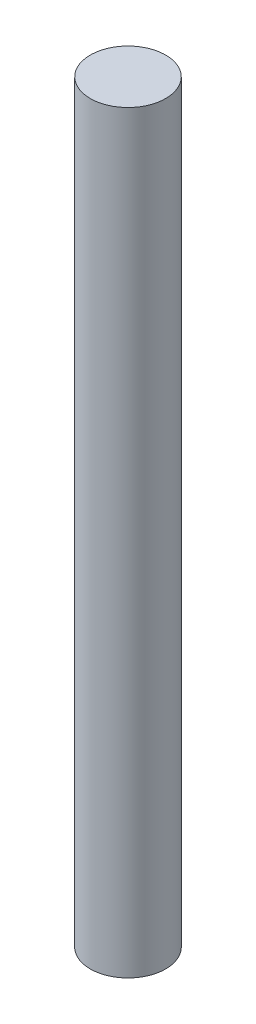
ISO-10303-21;
HEADER;
FILE_DESCRIPTION(('STEP AP214'),'2;1');
FILE_NAME('part.step','',(''),(''),'','','');
FILE_SCHEMA(('AUTOMOTIVE_DESIGN { 1 0 10303 214 1 1 1 1 }'));
ENDSEC;
DATA;
#1=APPLICATION_CONTEXT('core data for automotive mechanical design processes');
#2=APPLICATION_PROTOCOL_DEFINITION('international standard','automotive_design',2000,#1);
#3=PRODUCT_CONTEXT('',#1,'mechanical');
#4=PRODUCT('Part','Part','',(#3));
#5=PRODUCT_RELATED_PRODUCT_CATEGORY('part','',(#4));
#6=PRODUCT_DEFINITION_FORMATION('','',#4);
#7=PRODUCT_DEFINITION_CONTEXT('part definition',#1,'design');
#8=PRODUCT_DEFINITION('design','',#6,#7);
#9=PRODUCT_DEFINITION_SHAPE('','',#8);
#10=(LENGTH_UNIT() NAMED_UNIT(*) SI_UNIT(.MILLI.,.METRE.));
#11=(NAMED_UNIT(*) PLANE_ANGLE_UNIT() SI_UNIT($,.RADIAN.));
#12=(NAMED_UNIT(*) SI_UNIT($,.STERADIAN.) SOLID_ANGLE_UNIT());
#13=UNCERTAINTY_MEASURE_WITH_UNIT(LENGTH_MEASURE(1.E-05),#10,'distance_accuracy_value','');
#14=(GEOMETRIC_REPRESENTATION_CONTEXT(3) GLOBAL_UNCERTAINTY_ASSIGNED_CONTEXT((#13)) GLOBAL_UNIT_ASSIGNED_CONTEXT((#10,
#11,#12)) REPRESENTATION_CONTEXT('',''));
#15=CARTESIAN_POINT('',(0.,0.,0.));
#16=DIRECTION('',(0.,0.,1.));
#17=DIRECTION('',(1.,0.,0.));
#18=AXIS2_PLACEMENT_3D('',#15,#16,#17);
#19=CARTESIAN_POINT('',(0.,200.,0.));
#20=DIRECTION('',(0.,-1.,0.));
#21=DIRECTION('',(0.,0.,-1.));
#22=AXIS2_PLACEMENT_3D('',#19,#20,#21);
#23=CYLINDRICAL_SURFACE('',#22,10.);
#24=CARTESIAN_POINT('',(0.,200.,0.));
#25=DIRECTION('',(0.,1.,0.));
#26=DIRECTION('',(0.,0.,1.));
#27=AXIS2_PLACEMENT_3D('',#24,#25,#26);
#28=CIRCLE('',#27,10.);
#29=CARTESIAN_POINT('',(0.,200.,10.));
#30=VERTEX_POINT('',#29);
#31=EDGE_CURVE('E10',#30,#30,#28,.T.);
#32=ORIENTED_EDGE('',*,*,#31,.F.);
#33=EDGE_LOOP('',(#32));
#34=FACE_BOUND('',#33,.T.);
#35=CARTESIAN_POINT('',(0.,0.,0.));
#36=DIRECTION('',(0.,1.,0.));
#37=DIRECTION('',(0.,0.,1.));
#38=AXIS2_PLACEMENT_3D('',#35,#36,#37);
#39=CIRCLE('',#38,10.);
#40=CARTESIAN_POINT('',(0.,0.,10.));
#41=VERTEX_POINT('',#40);
#42=EDGE_CURVE('E34',#41,#41,#39,.T.);
#43=ORIENTED_EDGE('',*,*,#42,.T.);
#44=EDGE_LOOP('',(#43));
#45=FACE_BOUND('',#44,.T.);
#46=ADVANCED_FACE('F31',(#34,#45),#23,.T.);
#47=CARTESIAN_POINT('',(0.,200.,0.));
#48=DIRECTION('',(0.,1.,0.));
#49=DIRECTION('',(0.,0.,1.));
#50=AXIS2_PLACEMENT_3D('',#47,#48,#49);
#51=PLANE('',#50);
#52=ORIENTED_EDGE('',*,*,#31,.T.);
#53=EDGE_LOOP('',(#52));
#54=FACE_BOUND('',#53,.T.);
#55=ADVANCED_FACE('F46',(#54),#51,.T.);
#56=CARTESIAN_POINT('',(0.,0.,0.));
#57=DIRECTION('',(0.,1.,0.));
#58=DIRECTION('',(0.,0.,1.));
#59=AXIS2_PLACEMENT_3D('',#56,#57,#58);
#60=PLANE('',#59);
#61=ORIENTED_EDGE('',*,*,#42,.F.);
#62=EDGE_LOOP('',(#61));
#63=FACE_BOUND('',#62,.T.);
#64=ADVANCED_FACE('F44',(#63),#60,.F.);
#65=CLOSED_SHELL('',(#46,#55,#64));
#66=MANIFOLD_SOLID_BREP('B2',#65);
#67=ADVANCED_BREP_SHAPE_REPRESENTATION('',(#18,#66),#14);
#68=SHAPE_DEFINITION_REPRESENTATION(#9,#67);
ENDSEC;
END-ISO-10303-21;
